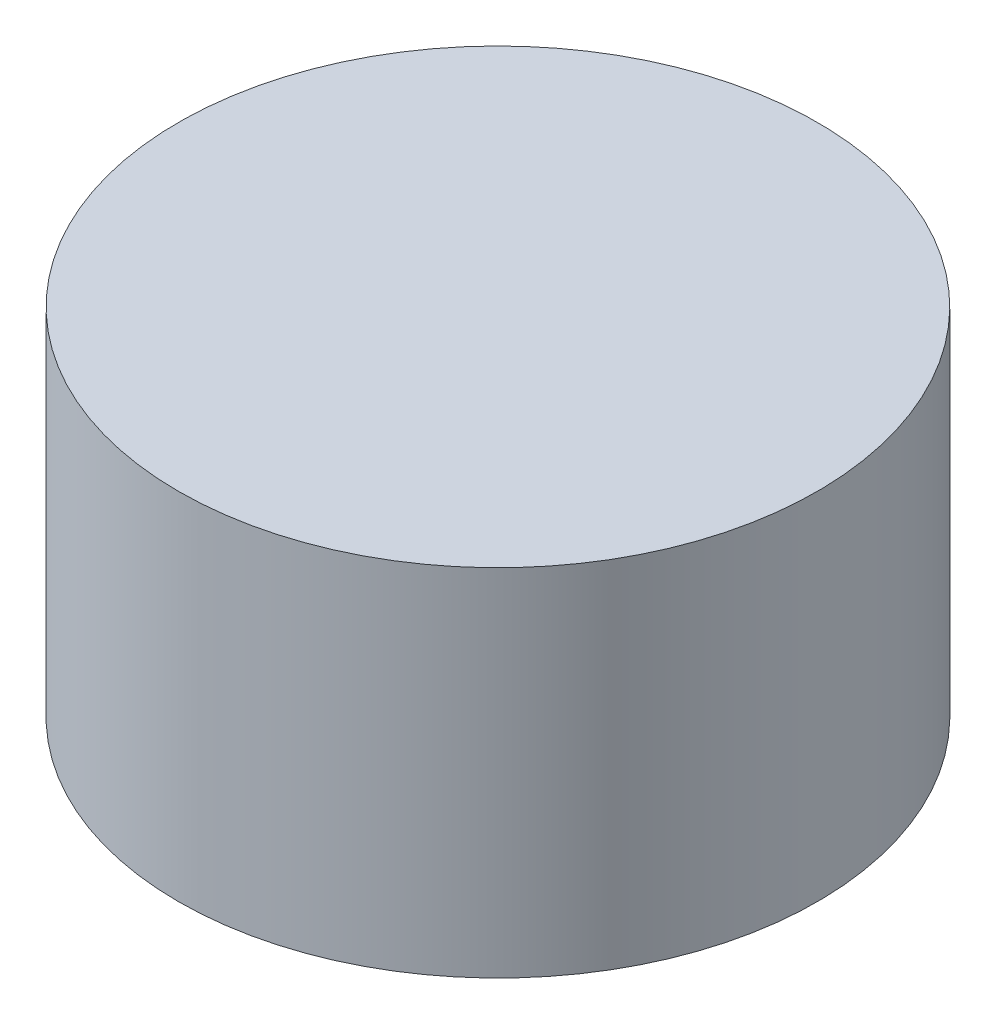
ISO-10303-21;
HEADER;
FILE_DESCRIPTION(('STEP AP214'),'2;1');
FILE_NAME('part.step','',(''),(''),'','','');
FILE_SCHEMA(('AUTOMOTIVE_DESIGN { 1 0 10303 214 1 1 1 1 }'));
ENDSEC;
DATA;
#1=APPLICATION_CONTEXT('core data for automotive mechanical design processes');
#2=APPLICATION_PROTOCOL_DEFINITION('international standard','automotive_design',2000,#1);
#3=PRODUCT_CONTEXT('',#1,'mechanical');
#4=PRODUCT('Part','Part','',(#3));
#5=PRODUCT_RELATED_PRODUCT_CATEGORY('part','',(#4));
#6=PRODUCT_DEFINITION_FORMATION('','',#4);
#7=PRODUCT_DEFINITION_CONTEXT('part definition',#1,'design');
#8=PRODUCT_DEFINITION('design','',#6,#7);
#9=PRODUCT_DEFINITION_SHAPE('','',#8);
#10=(LENGTH_UNIT() NAMED_UNIT(*) SI_UNIT(.MILLI.,.METRE.));
#11=(NAMED_UNIT(*) PLANE_ANGLE_UNIT() SI_UNIT($,.RADIAN.));
#12=(NAMED_UNIT(*) SI_UNIT($,.STERADIAN.) SOLID_ANGLE_UNIT());
#13=UNCERTAINTY_MEASURE_WITH_UNIT(LENGTH_MEASURE(1.E-05),#10,'distance_accuracy_value','');
#14=(GEOMETRIC_REPRESENTATION_CONTEXT(3) GLOBAL_UNCERTAINTY_ASSIGNED_CONTEXT((#13)) GLOBAL_UNIT_ASSIGNED_CONTEXT((#10,
#11,#12)) REPRESENTATION_CONTEXT('',''));
#15=CARTESIAN_POINT('',(0.,0.,0.));
#16=DIRECTION('',(0.,0.,1.));
#17=DIRECTION('',(1.,0.,0.));
#18=AXIS2_PLACEMENT_3D('',#15,#16,#17);
#19=CARTESIAN_POINT('',(0.,40.,0.));
#20=DIRECTION('',(0.,-1.,0.));
#21=DIRECTION('',(0.,0.,-1.));
#22=AXIS2_PLACEMENT_3D('',#19,#20,#21);
#23=CYLINDRICAL_SURFACE('',#22,35.963227587625);
#24=CARTESIAN_POINT('',(0.,40.,0.));
#25=DIRECTION('',(0.,1.,0.));
#26=DIRECTION('',(0.,0.,1.));
#27=AXIS2_PLACEMENT_3D('',#24,#25,#26);
#28=CIRCLE('',#27,35.963227587625);
#29=CARTESIAN_POINT('',(0.,40.,35.963227587625));
#30=VERTEX_POINT('',#29);
#31=EDGE_CURVE('E10',#30,#30,#28,.T.);
#32=ORIENTED_EDGE('',*,*,#31,.F.);
#33=EDGE_LOOP('',(#32));
#34=FACE_BOUND('',#33,.T.);
#35=CARTESIAN_POINT('',(0.,0.,0.));
#36=DIRECTION('',(0.,1.,0.));
#37=DIRECTION('',(0.,0.,1.));
#38=AXIS2_PLACEMENT_3D('',#35,#36,#37);
#39=CIRCLE('',#38,35.963227587625);
#40=CARTESIAN_POINT('',(0.,0.,35.963227587625));
#41=VERTEX_POINT('',#40);
#42=EDGE_CURVE('E38',#41,#41,#39,.T.);
#43=ORIENTED_EDGE('',*,*,#42,.T.);
#44=EDGE_LOOP('',(#43));
#45=FACE_BOUND('',#44,.T.);
#46=ADVANCED_FACE('F35',(#34,#45),#23,.T.);
#47=CARTESIAN_POINT('',(0.,40.,0.));
#48=DIRECTION('',(0.,1.,0.));
#49=DIRECTION('',(0.,0.,1.));
#50=AXIS2_PLACEMENT_3D('',#47,#48,#49);
#51=PLANE('',#50);
#52=ORIENTED_EDGE('',*,*,#31,.T.);
#53=EDGE_LOOP('',(#52));
#54=FACE_BOUND('',#53,.T.);
#55=ADVANCED_FACE('F52',(#54),#51,.T.);
#56=CARTESIAN_POINT('',(0.,0.,0.));
#57=DIRECTION('',(0.,1.,0.));
#58=DIRECTION('',(0.,0.,1.));
#59=AXIS2_PLACEMENT_3D('',#56,#57,#58);
#60=PLANE('',#59);
#61=ORIENTED_EDGE('',*,*,#42,.F.);
#62=EDGE_LOOP('',(#61));
#63=FACE_BOUND('',#62,.T.);
#64=ADVANCED_FACE('F50',(#63),#60,.F.);
#65=CLOSED_SHELL('',(#46,#55,#64));
#66=MANIFOLD_SOLID_BREP('B2',#65);
#67=ADVANCED_BREP_SHAPE_REPRESENTATION('',(#18,#66),#14);
#68=SHAPE_DEFINITION_REPRESENTATION(#9,#67);
ENDSEC;
END-ISO-10303-21;
